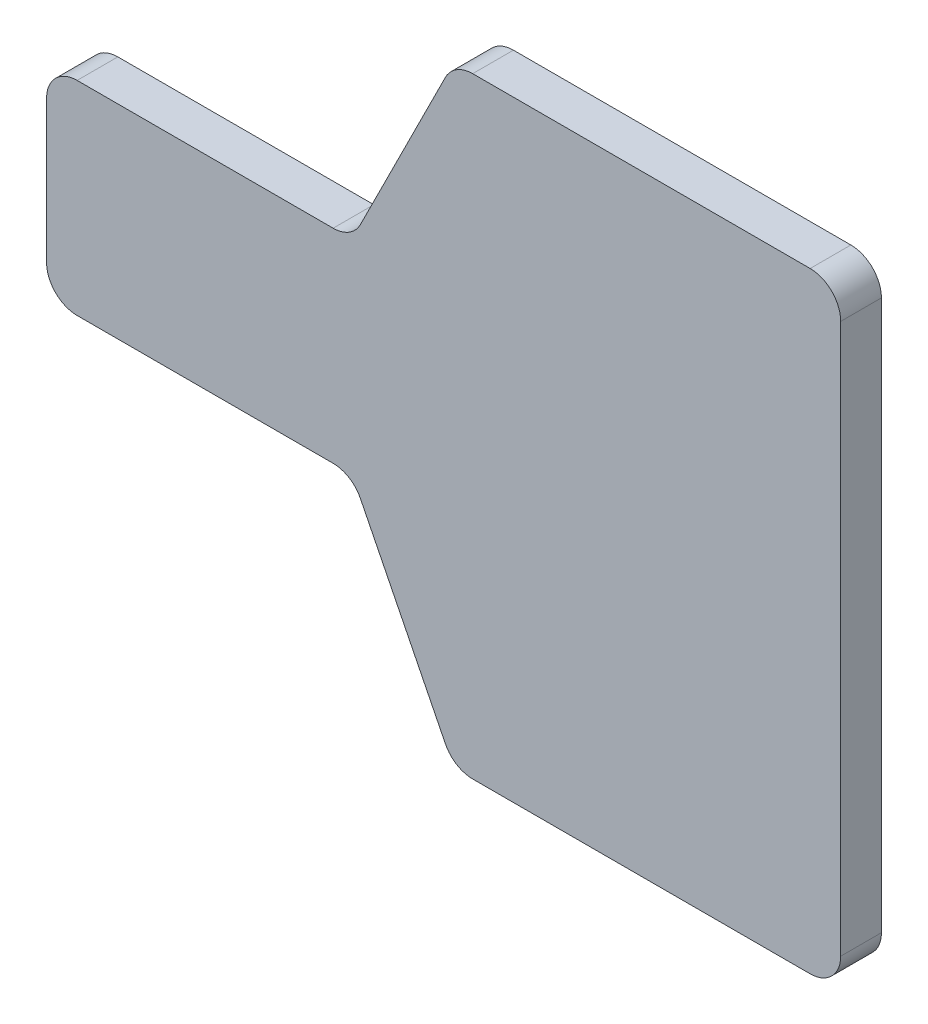
ISO-10303-21;
HEADER;
FILE_DESCRIPTION(('STEP AP214'),'2;1');
FILE_NAME('part.step','',(''),(''),'','','');
FILE_SCHEMA(('AUTOMOTIVE_DESIGN { 1 0 10303 214 1 1 1 1 }'));
ENDSEC;
DATA;
#1=APPLICATION_CONTEXT('core data for automotive mechanical design processes');
#2=APPLICATION_PROTOCOL_DEFINITION('international standard','automotive_design',2000,#1);
#3=PRODUCT_CONTEXT('',#1,'mechanical');
#4=PRODUCT('Part','Part','',(#3));
#5=PRODUCT_RELATED_PRODUCT_CATEGORY('part','',(#4));
#6=PRODUCT_DEFINITION_FORMATION('','',#4);
#7=PRODUCT_DEFINITION_CONTEXT('part definition',#1,'design');
#8=PRODUCT_DEFINITION('design','',#6,#7);
#9=PRODUCT_DEFINITION_SHAPE('','',#8);
#10=(LENGTH_UNIT() NAMED_UNIT(*) SI_UNIT(.MILLI.,.METRE.));
#11=(NAMED_UNIT(*) PLANE_ANGLE_UNIT() SI_UNIT($,.RADIAN.));
#12=(NAMED_UNIT(*) SI_UNIT($,.STERADIAN.) SOLID_ANGLE_UNIT());
#13=UNCERTAINTY_MEASURE_WITH_UNIT(LENGTH_MEASURE(1.E-05),#10,'distance_accuracy_value','');
#14=(GEOMETRIC_REPRESENTATION_CONTEXT(3) GLOBAL_UNCERTAINTY_ASSIGNED_CONTEXT((#13)) GLOBAL_UNIT_ASSIGNED_CONTEXT((#10,
#11,#12)) REPRESENTATION_CONTEXT('',''));
#15=CARTESIAN_POINT('',(0.,0.,0.));
#16=DIRECTION('',(0.,0.,1.));
#17=DIRECTION('',(1.,0.,0.));
#18=AXIS2_PLACEMENT_3D('',#15,#16,#17);
#19=CARTESIAN_POINT('',(0.,-10.,4.));
#20=DIRECTION('',(0.,1.,0.));
#21=DIRECTION('',(0.,0.,1.));
#22=AXIS2_PLACEMENT_3D('',#19,#20,#21);
#23=PLANE('',#22);
#24=DIRECTION('',(1.,0.,0.));
#25=VECTOR('',#24,1.);
#26=CARTESIAN_POINT('',(0.,-10.,0.));
#27=LINE('',#26,#25);
#28=CARTESIAN_POINT('',(-27.,-10.,0.));
#29=VERTEX_POINT('',#28);
#30=CARTESIAN_POINT('',(-1.85410196624969,-10.,0.));
#31=VERTEX_POINT('',#30);
#32=EDGE_CURVE('E246',#29,#31,#27,.T.);
#33=ORIENTED_EDGE('',*,*,#32,.T.);
#34=DIRECTION('',(0.,0.,-1.));
#35=VECTOR('',#34,1.);
#36=CARTESIAN_POINT('',(-1.85410196624969,-10.,4.));
#37=LINE('',#36,#35);
#38=CARTESIAN_POINT('',(-1.85410196624969,-10.,4.));
#39=VERTEX_POINT('',#38);
#40=EDGE_CURVE('E239',#31,#39,#37,.F.);
#41=ORIENTED_EDGE('',*,*,#40,.T.);
#42=DIRECTION('',(1.,0.,0.));
#43=VECTOR('',#42,1.);
#44=CARTESIAN_POINT('',(0.,-10.,4.));
#45=LINE('',#44,#43);
#46=CARTESIAN_POINT('',(-27.,-10.,4.));
#47=VERTEX_POINT('',#46);
#48=EDGE_CURVE('E179',#47,#39,#45,.T.);
#49=ORIENTED_EDGE('',*,*,#48,.F.);
#50=DIRECTION('',(0.,0.,-1.));
#51=VECTOR('',#50,1.);
#52=CARTESIAN_POINT('',(-27.,-10.,4.));
#53=LINE('',#52,#51);
#54=EDGE_CURVE('E236',#47,#29,#53,.T.);
#55=ORIENTED_EDGE('',*,*,#54,.T.);
#56=EDGE_LOOP('',(#33,#41,#49,#55));
#57=FACE_BOUND('',#56,.T.);
#58=ADVANCED_FACE('F39',(#57),#23,.F.);
#59=CARTESIAN_POINT('',(0.,-10.,4.));
#60=DIRECTION('',(0.894427190999916,0.447213595499958,0.));
#61=DIRECTION('',(-0.447213595499958,0.894427190999916,0.));
#62=AXIS2_PLACEMENT_3D('',#59,#60,#61);
#63=PLANE('',#62);
#64=DIRECTION('',(0.447213595499958,-0.894427190999916,0.));
#65=VECTOR('',#64,1.);
#66=CARTESIAN_POINT('',(0.,-10.,0.));
#67=LINE('',#66,#65);
#68=CARTESIAN_POINT('',(0.82917960675006,-11.6583592135001,0.));
#69=VERTEX_POINT('',#68);
#70=CARTESIAN_POINT('',(9.17082039324994,-28.3416407864999,0.));
#71=VERTEX_POINT('',#70);
#72=EDGE_CURVE('E248',#69,#71,#67,.T.);
#73=ORIENTED_EDGE('',*,*,#72,.T.);
#74=DIRECTION('',(0.,0.,-1.));
#75=VECTOR('',#74,1.);
#76=CARTESIAN_POINT('',(9.17082039324994,-28.3416407864999,4.));
#77=LINE('',#76,#75);
#78=CARTESIAN_POINT('',(9.17082039324994,-28.3416407864999,4.));
#79=VERTEX_POINT('',#78);
#80=EDGE_CURVE('E234',#71,#79,#77,.F.);
#81=ORIENTED_EDGE('',*,*,#80,.T.);
#82=DIRECTION('',(0.447213595499958,-0.894427190999916,0.));
#83=VECTOR('',#82,1.);
#84=CARTESIAN_POINT('',(0.,-10.,4.));
#85=LINE('',#84,#83);
#86=CARTESIAN_POINT('',(0.82917960675006,-11.6583592135001,4.));
#87=VERTEX_POINT('',#86);
#88=EDGE_CURVE('E183',#87,#79,#85,.T.);
#89=ORIENTED_EDGE('',*,*,#88,.F.);
#90=DIRECTION('',(0.,0.,-1.));
#91=VECTOR('',#90,1.);
#92=CARTESIAN_POINT('',(0.82917960675006,-11.6583592135001,0.));
#93=LINE('',#92,#91);
#94=EDGE_CURVE('E231',#87,#69,#93,.T.);
#95=ORIENTED_EDGE('',*,*,#94,.T.);
#96=EDGE_LOOP('',(#73,#81,#89,#95));
#97=FACE_BOUND('',#96,.T.);
#98=ADVANCED_FACE('F264',(#97),#63,.F.);
#99=CARTESIAN_POINT('',(48.,-30.,4.));
#100=DIRECTION('',(0.,1.,0.));
#101=DIRECTION('',(-1.,0.,0.));
#102=AXIS2_PLACEMENT_3D('',#99,#100,#101);
#103=PLANE('',#102);
#104=DIRECTION('',(1.,0.,0.));
#105=VECTOR('',#104,1.);
#106=CARTESIAN_POINT('',(48.,-30.,0.));
#107=LINE('',#106,#105);
#108=CARTESIAN_POINT('',(11.8541019662497,-30.,0.));
#109=VERTEX_POINT('',#108);
#110=CARTESIAN_POINT('',(45.,-30.,0.));
#111=VERTEX_POINT('',#110);
#112=EDGE_CURVE('E282',#109,#111,#107,.T.);
#113=ORIENTED_EDGE('',*,*,#112,.T.);
#114=DIRECTION('',(0.,0.,-1.));
#115=VECTOR('',#114,1.);
#116=CARTESIAN_POINT('',(45.,-30.,4.));
#117=LINE('',#116,#115);
#118=CARTESIAN_POINT('',(45.,-30.,4.));
#119=VERTEX_POINT('',#118);
#120=EDGE_CURVE('E229',#111,#119,#117,.F.);
#121=ORIENTED_EDGE('',*,*,#120,.T.);
#122=DIRECTION('',(1.,0.,0.));
#123=VECTOR('',#122,1.);
#124=CARTESIAN_POINT('',(30.,-30.,4.));
#125=LINE('',#124,#123);
#126=CARTESIAN_POINT('',(11.8541019662497,-30.,4.));
#127=VERTEX_POINT('',#126);
#128=EDGE_CURVE('E266',#127,#119,#125,.T.);
#129=ORIENTED_EDGE('',*,*,#128,.F.);
#130=DIRECTION('',(0.,0.,-1.));
#131=VECTOR('',#130,1.);
#132=CARTESIAN_POINT('',(11.8541019662497,-30.,4.));
#133=LINE('',#132,#131);
#134=EDGE_CURVE('E226',#127,#109,#133,.T.);
#135=ORIENTED_EDGE('',*,*,#134,.T.);
#136=EDGE_LOOP('',(#113,#121,#129,#135));
#137=FACE_BOUND('',#136,.T.);
#138=ADVANCED_FACE('F314',(#137),#103,.F.);
#139=CARTESIAN_POINT('',(48.,30.,4.));
#140=DIRECTION('',(-1.,0.,0.));
#141=DIRECTION('',(0.,-1.,0.));
#142=AXIS2_PLACEMENT_3D('',#139,#140,#141);
#143=PLANE('',#142);
#144=DIRECTION('',(0.,1.,0.));
#145=VECTOR('',#144,1.);
#146=CARTESIAN_POINT('',(48.,30.,0.));
#147=LINE('',#146,#145);
#148=CARTESIAN_POINT('',(48.,-27.,0.));
#149=VERTEX_POINT('',#148);
#150=CARTESIAN_POINT('',(48.,27.,0.));
#151=VERTEX_POINT('',#150);
#152=EDGE_CURVE('E285',#149,#151,#147,.T.);
#153=ORIENTED_EDGE('',*,*,#152,.T.);
#154=DIRECTION('',(0.,0.,-1.));
#155=VECTOR('',#154,1.);
#156=CARTESIAN_POINT('',(48.,27.,4.));
#157=LINE('',#156,#155);
#158=CARTESIAN_POINT('',(48.,27.,4.));
#159=VERTEX_POINT('',#158);
#160=EDGE_CURVE('E224',#151,#159,#157,.F.);
#161=ORIENTED_EDGE('',*,*,#160,.T.);
#162=DIRECTION('',(0.,1.,0.));
#163=VECTOR('',#162,1.);
#164=CARTESIAN_POINT('',(48.,30.,4.));
#165=LINE('',#164,#163);
#166=CARTESIAN_POINT('',(48.,-27.,4.));
#167=VERTEX_POINT('',#166);
#168=EDGE_CURVE('E269',#167,#159,#165,.T.);
#169=ORIENTED_EDGE('',*,*,#168,.F.);
#170=DIRECTION('',(0.,0.,-1.));
#171=VECTOR('',#170,1.);
#172=CARTESIAN_POINT('',(48.,-27.,4.));
#173=LINE('',#172,#171);
#174=EDGE_CURVE('E221',#167,#149,#173,.T.);
#175=ORIENTED_EDGE('',*,*,#174,.T.);
#176=EDGE_LOOP('',(#153,#161,#169,#175));
#177=FACE_BOUND('',#176,.T.);
#178=ADVANCED_FACE('F439',(#177),#143,.F.);
#179=CARTESIAN_POINT('',(30.,30.,4.));
#180=DIRECTION('',(0.,-1.,0.));
#181=DIRECTION('',(0.,0.,-1.));
#182=AXIS2_PLACEMENT_3D('',#179,#180,#181);
#183=PLANE('',#182);
#184=DIRECTION('',(-1.,0.,0.));
#185=VECTOR('',#184,1.);
#186=CARTESIAN_POINT('',(30.,30.,0.));
#187=LINE('',#186,#185);
#188=CARTESIAN_POINT('',(45.,30.,0.));
#189=VERTEX_POINT('',#188);
#190=CARTESIAN_POINT('',(11.8541019662497,30.,0.));
#191=VERTEX_POINT('',#190);
#192=EDGE_CURVE('E288',#189,#191,#187,.T.);
#193=ORIENTED_EDGE('',*,*,#192,.T.);
#194=DIRECTION('',(0.,0.,-1.));
#195=VECTOR('',#194,1.);
#196=CARTESIAN_POINT('',(11.8541019662497,30.,4.));
#197=LINE('',#196,#195);
#198=CARTESIAN_POINT('',(11.8541019662497,30.,4.));
#199=VERTEX_POINT('',#198);
#200=EDGE_CURVE('E219',#191,#199,#197,.F.);
#201=ORIENTED_EDGE('',*,*,#200,.T.);
#202=DIRECTION('',(-1.,0.,0.));
#203=VECTOR('',#202,1.);
#204=CARTESIAN_POINT('',(30.,30.,4.));
#205=LINE('',#204,#203);
#206=CARTESIAN_POINT('',(45.,30.,4.));
#207=VERTEX_POINT('',#206);
#208=EDGE_CURVE('E274',#207,#199,#205,.T.);
#209=ORIENTED_EDGE('',*,*,#208,.F.);
#210=DIRECTION('',(0.,0.,-1.));
#211=VECTOR('',#210,1.);
#212=CARTESIAN_POINT('',(45.,30.,4.));
#213=LINE('',#212,#211);
#214=EDGE_CURVE('E216',#207,#189,#213,.T.);
#215=ORIENTED_EDGE('',*,*,#214,.T.);
#216=EDGE_LOOP('',(#193,#201,#209,#215));
#217=FACE_BOUND('',#216,.T.);
#218=ADVANCED_FACE('F307',(#217),#183,.F.);
#219=CARTESIAN_POINT('',(10.,30.,4.));
#220=DIRECTION('',(0.894427190999916,-0.447213595499958,0.));
#221=DIRECTION('',(0.447213595499958,0.894427190999916,0.));
#222=AXIS2_PLACEMENT_3D('',#219,#220,#221);
#223=PLANE('',#222);
#224=DIRECTION('',(-0.447213595499958,-0.894427190999916,0.));
#225=VECTOR('',#224,1.);
#226=CARTESIAN_POINT('',(10.,30.,0.));
#227=LINE('',#226,#225);
#228=CARTESIAN_POINT('',(9.17082039324994,28.3416407864999,0.));
#229=VERTEX_POINT('',#228);
#230=CARTESIAN_POINT('',(0.829179606750063,11.6583592135001,0.));
#231=VERTEX_POINT('',#230);
#232=EDGE_CURVE('E185',#229,#231,#227,.T.);
#233=ORIENTED_EDGE('',*,*,#232,.T.);
#234=DIRECTION('',(0.,0.,-1.));
#235=VECTOR('',#234,1.);
#236=CARTESIAN_POINT('',(0.829179606750064,11.6583592135001,4.));
#237=LINE('',#236,#235);
#238=CARTESIAN_POINT('',(0.829179606750063,11.6583592135001,4.));
#239=VERTEX_POINT('',#238);
#240=EDGE_CURVE('E54',#231,#239,#237,.F.);
#241=ORIENTED_EDGE('',*,*,#240,.T.);
#242=DIRECTION('',(-0.447213595499958,-0.894427190999916,0.));
#243=VECTOR('',#242,1.);
#244=CARTESIAN_POINT('',(10.,30.,4.));
#245=LINE('',#244,#243);
#246=CARTESIAN_POINT('',(9.17082039324994,28.3416407864999,4.));
#247=VERTEX_POINT('',#246);
#248=EDGE_CURVE('E276',#247,#239,#245,.T.);
#249=ORIENTED_EDGE('',*,*,#248,.F.);
#250=DIRECTION('',(0.,0.,-1.));
#251=VECTOR('',#250,1.);
#252=CARTESIAN_POINT('',(9.17082039324994,28.3416407864999,4.));
#253=LINE('',#252,#251);
#254=EDGE_CURVE('E212',#247,#229,#253,.T.);
#255=ORIENTED_EDGE('',*,*,#254,.T.);
#256=EDGE_LOOP('',(#233,#241,#249,#255));
#257=FACE_BOUND('',#256,.T.);
#258=ADVANCED_FACE('F291',(#257),#223,.F.);
#259=CARTESIAN_POINT('',(0.,10.,4.));
#260=DIRECTION('',(0.,-1.,0.));
#261=DIRECTION('',(0.,0.,-1.));
#262=AXIS2_PLACEMENT_3D('',#259,#260,#261);
#263=PLANE('',#262);
#264=DIRECTION('',(-1.,0.,0.));
#265=VECTOR('',#264,1.);
#266=CARTESIAN_POINT('',(0.,10.,0.));
#267=LINE('',#266,#265);
#268=CARTESIAN_POINT('',(-1.85410196624969,10.,0.));
#269=VERTEX_POINT('',#268);
#270=CARTESIAN_POINT('',(-27.,10.,0.));
#271=VERTEX_POINT('',#270);
#272=EDGE_CURVE('E180',#269,#271,#267,.T.);
#273=ORIENTED_EDGE('',*,*,#272,.T.);
#274=DIRECTION('',(0.,0.,-1.));
#275=VECTOR('',#274,1.);
#276=CARTESIAN_POINT('',(-27.,10.,4.));
#277=LINE('',#276,#275);
#278=CARTESIAN_POINT('',(-27.,10.,4.));
#279=VERTEX_POINT('',#278);
#280=EDGE_CURVE('E158',#271,#279,#277,.F.);
#281=ORIENTED_EDGE('',*,*,#280,.T.);
#282=DIRECTION('',(-1.,0.,0.));
#283=VECTOR('',#282,1.);
#284=CARTESIAN_POINT('',(0.,10.,4.));
#285=LINE('',#284,#283);
#286=CARTESIAN_POINT('',(-1.85410196624969,10.,4.));
#287=VERTEX_POINT('',#286);
#288=EDGE_CURVE('E278',#287,#279,#285,.T.);
#289=ORIENTED_EDGE('',*,*,#288,.F.);
#290=DIRECTION('',(0.,0.,-1.));
#291=VECTOR('',#290,1.);
#292=CARTESIAN_POINT('',(-1.85410196624969,10.,0.));
#293=LINE('',#292,#291);
#294=EDGE_CURVE('E163',#287,#269,#293,.T.);
#295=ORIENTED_EDGE('',*,*,#294,.T.);
#296=EDGE_LOOP('',(#273,#281,#289,#295));
#297=FACE_BOUND('',#296,.T.);
#298=ADVANCED_FACE('F299',(#297),#263,.F.);
#299=CARTESIAN_POINT('',(-30.,-10.,4.));
#300=DIRECTION('',(1.,0.,0.));
#301=DIRECTION('',(0.,0.,-1.));
#302=AXIS2_PLACEMENT_3D('',#299,#300,#301);
#303=PLANE('',#302);
#304=DIRECTION('',(0.,-1.,0.));
#305=VECTOR('',#304,1.);
#306=CARTESIAN_POINT('',(-30.,-10.,4.));
#307=LINE('',#306,#305);
#308=CARTESIAN_POINT('',(-30.,7.,4.));
#309=VERTEX_POINT('',#308);
#310=CARTESIAN_POINT('',(-30.,-7.,4.));
#311=VERTEX_POINT('',#310);
#312=EDGE_CURVE('E173',#309,#311,#307,.T.);
#313=ORIENTED_EDGE('',*,*,#312,.F.);
#314=DIRECTION('',(0.,0.,-1.));
#315=VECTOR('',#314,1.);
#316=CARTESIAN_POINT('',(-30.,7.,4.));
#317=LINE('',#316,#315);
#318=CARTESIAN_POINT('',(-30.,7.,0.));
#319=VERTEX_POINT('',#318);
#320=EDGE_CURVE('E157',#309,#319,#317,.T.);
#321=ORIENTED_EDGE('',*,*,#320,.T.);
#322=DIRECTION('',(0.,-1.,0.));
#323=VECTOR('',#322,1.);
#324=CARTESIAN_POINT('',(-30.,-10.,0.));
#325=LINE('',#324,#323);
#326=CARTESIAN_POINT('',(-30.,-7.,0.));
#327=VERTEX_POINT('',#326);
#328=EDGE_CURVE('E170',#319,#327,#325,.T.);
#329=ORIENTED_EDGE('',*,*,#328,.T.);
#330=DIRECTION('',(0.,0.,-1.));
#331=VECTOR('',#330,1.);
#332=CARTESIAN_POINT('',(-30.,-7.,4.));
#333=LINE('',#332,#331);
#334=EDGE_CURVE('E175',#327,#311,#333,.F.);
#335=ORIENTED_EDGE('',*,*,#334,.T.);
#336=EDGE_LOOP('',(#313,#321,#329,#335));
#337=FACE_BOUND('',#336,.T.);
#338=ADVANCED_FACE('F169',(#337),#303,.F.);
#339=CARTESIAN_POINT('',(0.,0.,4.));
#340=DIRECTION('',(0.,0.,-1.));
#341=DIRECTION('',(-1.,0.,0.));
#342=AXIS2_PLACEMENT_3D('',#339,#340,#341);
#343=PLANE('',#342);
#344=ORIENTED_EDGE('',*,*,#288,.T.);
#345=CARTESIAN_POINT('',(-27.,7.,4.));
#346=DIRECTION('',(0.,0.,-1.));
#347=DIRECTION('',(-1.,0.,0.));
#348=AXIS2_PLACEMENT_3D('',#345,#346,#347);
#349=CIRCLE('',#348,3.);
#350=EDGE_CURVE('E210',#279,#309,#349,.F.);
#351=ORIENTED_EDGE('',*,*,#350,.T.);
#352=ORIENTED_EDGE('',*,*,#312,.T.);
#353=CARTESIAN_POINT('',(-27.,-7.,4.));
#354=DIRECTION('',(0.,0.,-1.));
#355=DIRECTION('',(-1.,0.,0.));
#356=AXIS2_PLACEMENT_3D('',#353,#354,#355);
#357=CIRCLE('',#356,3.);
#358=EDGE_CURVE('E201',#311,#47,#357,.F.);
#359=ORIENTED_EDGE('',*,*,#358,.T.);
#360=ORIENTED_EDGE('',*,*,#48,.T.);
#361=CARTESIAN_POINT('',(-1.85410196624969,-13.,4.));
#362=DIRECTION('',(0.,0.,-1.));
#363=DIRECTION('',(-1.,0.,0.));
#364=AXIS2_PLACEMENT_3D('',#361,#362,#363);
#365=CIRCLE('',#364,3.);
#366=EDGE_CURVE('E11',#39,#87,#365,.T.);
#367=ORIENTED_EDGE('',*,*,#366,.T.);
#368=ORIENTED_EDGE('',*,*,#88,.T.);
#369=CARTESIAN_POINT('',(11.8541019662497,-27.,4.));
#370=DIRECTION('',(0.,0.,-1.));
#371=DIRECTION('',(-1.,0.,0.));
#372=AXIS2_PLACEMENT_3D('',#369,#370,#371);
#373=CIRCLE('',#372,3.);
#374=EDGE_CURVE('E203',#79,#127,#373,.F.);
#375=ORIENTED_EDGE('',*,*,#374,.T.);
#376=ORIENTED_EDGE('',*,*,#128,.T.);
#377=CARTESIAN_POINT('',(45.,-27.,4.));
#378=DIRECTION('',(0.,0.,-1.));
#379=DIRECTION('',(-1.,0.,0.));
#380=AXIS2_PLACEMENT_3D('',#377,#378,#379);
#381=CIRCLE('',#380,3.);
#382=EDGE_CURVE('E205',#119,#167,#381,.F.);
#383=ORIENTED_EDGE('',*,*,#382,.T.);
#384=ORIENTED_EDGE('',*,*,#168,.T.);
#385=CARTESIAN_POINT('',(45.,27.,4.));
#386=DIRECTION('',(0.,0.,-1.));
#387=DIRECTION('',(-1.,0.,0.));
#388=AXIS2_PLACEMENT_3D('',#385,#386,#387);
#389=CIRCLE('',#388,3.);
#390=EDGE_CURVE('E207',#159,#207,#389,.F.);
#391=ORIENTED_EDGE('',*,*,#390,.T.);
#392=ORIENTED_EDGE('',*,*,#208,.T.);
#393=CARTESIAN_POINT('',(11.8541019662497,27.,4.));
#394=DIRECTION('',(0.,0.,-1.));
#395=DIRECTION('',(-1.,0.,0.));
#396=AXIS2_PLACEMENT_3D('',#393,#394,#395);
#397=CIRCLE('',#396,3.);
#398=EDGE_CURVE('E61',#199,#247,#397,.F.);
#399=ORIENTED_EDGE('',*,*,#398,.T.);
#400=ORIENTED_EDGE('',*,*,#248,.T.);
#401=CARTESIAN_POINT('',(-1.85410196624969,13.,4.));
#402=DIRECTION('',(0.,0.,-1.));
#403=DIRECTION('',(-1.,0.,0.));
#404=AXIS2_PLACEMENT_3D('',#401,#402,#403);
#405=CIRCLE('',#404,3.);
#406=EDGE_CURVE('E243',#239,#287,#405,.T.);
#407=ORIENTED_EDGE('',*,*,#406,.T.);
#408=EDGE_LOOP('',(#344,#351,#352,#359,#360,#367,#368,#375,#376,#383,#384,#391,#392,#399,#400,#407));
#409=FACE_BOUND('',#408,.T.);
#410=ADVANCED_FACE('F261',(#409),#343,.F.);
#411=CARTESIAN_POINT('',(0.,0.,0.));
#412=DIRECTION('',(0.,0.,-1.));
#413=DIRECTION('',(-1.,0.,0.));
#414=AXIS2_PLACEMENT_3D('',#411,#412,#413);
#415=PLANE('',#414);
#416=ORIENTED_EDGE('',*,*,#328,.F.);
#417=CARTESIAN_POINT('',(-27.,7.,0.));
#418=DIRECTION('',(0.,0.,-1.));
#419=DIRECTION('',(-1.,0.,0.));
#420=AXIS2_PLACEMENT_3D('',#417,#418,#419);
#421=CIRCLE('',#420,3.);
#422=EDGE_CURVE('E153',#319,#271,#421,.T.);
#423=ORIENTED_EDGE('',*,*,#422,.T.);
#424=ORIENTED_EDGE('',*,*,#272,.F.);
#425=CARTESIAN_POINT('',(-1.85410196624969,13.,0.));
#426=DIRECTION('',(0.,0.,-1.));
#427=DIRECTION('',(-1.,0.,0.));
#428=AXIS2_PLACEMENT_3D('',#425,#426,#427);
#429=CIRCLE('',#428,3.);
#430=EDGE_CURVE('E241',#269,#231,#429,.F.);
#431=ORIENTED_EDGE('',*,*,#430,.T.);
#432=ORIENTED_EDGE('',*,*,#232,.F.);
#433=CARTESIAN_POINT('',(11.8541019662497,27.,0.));
#434=DIRECTION('',(0.,0.,-1.));
#435=DIRECTION('',(-1.,0.,0.));
#436=AXIS2_PLACEMENT_3D('',#433,#434,#435);
#437=CIRCLE('',#436,3.);
#438=EDGE_CURVE('E164',#229,#191,#437,.T.);
#439=ORIENTED_EDGE('',*,*,#438,.T.);
#440=ORIENTED_EDGE('',*,*,#192,.F.);
#441=CARTESIAN_POINT('',(45.,27.,0.));
#442=DIRECTION('',(0.,0.,-1.));
#443=DIRECTION('',(-1.,0.,0.));
#444=AXIS2_PLACEMENT_3D('',#441,#442,#443);
#445=CIRCLE('',#444,3.);
#446=EDGE_CURVE('E195',#189,#151,#445,.T.);
#447=ORIENTED_EDGE('',*,*,#446,.T.);
#448=ORIENTED_EDGE('',*,*,#152,.F.);
#449=CARTESIAN_POINT('',(45.,-27.,0.));
#450=DIRECTION('',(0.,0.,-1.));
#451=DIRECTION('',(-1.,0.,0.));
#452=AXIS2_PLACEMENT_3D('',#449,#450,#451);
#453=CIRCLE('',#452,3.);
#454=EDGE_CURVE('E193',#149,#111,#453,.T.);
#455=ORIENTED_EDGE('',*,*,#454,.T.);
#456=ORIENTED_EDGE('',*,*,#112,.F.);
#457=CARTESIAN_POINT('',(11.8541019662497,-27.,0.));
#458=DIRECTION('',(0.,0.,-1.));
#459=DIRECTION('',(-1.,0.,0.));
#460=AXIS2_PLACEMENT_3D('',#457,#458,#459);
#461=CIRCLE('',#460,3.);
#462=EDGE_CURVE('E191',#109,#71,#461,.T.);
#463=ORIENTED_EDGE('',*,*,#462,.T.);
#464=ORIENTED_EDGE('',*,*,#72,.F.);
#465=CARTESIAN_POINT('',(-1.85410196624969,-13.,0.));
#466=DIRECTION('',(0.,0.,-1.));
#467=DIRECTION('',(-1.,0.,0.));
#468=AXIS2_PLACEMENT_3D('',#465,#466,#467);
#469=CIRCLE('',#468,3.);
#470=EDGE_CURVE('E47',#69,#31,#469,.F.);
#471=ORIENTED_EDGE('',*,*,#470,.T.);
#472=ORIENTED_EDGE('',*,*,#32,.F.);
#473=CARTESIAN_POINT('',(-27.,-7.,0.));
#474=DIRECTION('',(0.,0.,-1.));
#475=DIRECTION('',(-1.,0.,0.));
#476=AXIS2_PLACEMENT_3D('',#473,#474,#475);
#477=CIRCLE('',#476,3.);
#478=EDGE_CURVE('E174',#29,#327,#477,.T.);
#479=ORIENTED_EDGE('',*,*,#478,.T.);
#480=EDGE_LOOP('',(#416,#423,#424,#431,#432,#439,#440,#447,#448,#455,#456,#463,#464,#471,#472,#479));
#481=FACE_BOUND('',#480,.T.);
#482=ADVANCED_FACE('F177',(#481),#415,.T.);
#483=CARTESIAN_POINT('',(-27.,7.,4.));
#484=DIRECTION('',(0.,0.,-1.));
#485=DIRECTION('',(-1.,0.,0.));
#486=AXIS2_PLACEMENT_3D('',#483,#484,#485);
#487=CYLINDRICAL_SURFACE('',#486,3.);
#488=ORIENTED_EDGE('',*,*,#350,.F.);
#489=ORIENTED_EDGE('',*,*,#280,.F.);
#490=ORIENTED_EDGE('',*,*,#422,.F.);
#491=ORIENTED_EDGE('',*,*,#320,.F.);
#492=EDGE_LOOP('',(#488,#489,#490,#491));
#493=FACE_BOUND('',#492,.T.);
#494=ADVANCED_FACE('F156',(#493),#487,.T.);
#495=CARTESIAN_POINT('',(-1.85410196624969,13.,4.));
#496=DIRECTION('',(0.,0.,1.));
#497=DIRECTION('',(1.,0.,0.));
#498=AXIS2_PLACEMENT_3D('',#495,#496,#497);
#499=CYLINDRICAL_SURFACE('',#498,3.);
#500=ORIENTED_EDGE('',*,*,#406,.F.);
#501=ORIENTED_EDGE('',*,*,#240,.F.);
#502=ORIENTED_EDGE('',*,*,#430,.F.);
#503=ORIENTED_EDGE('',*,*,#294,.F.);
#504=EDGE_LOOP('',(#500,#501,#502,#503));
#505=FACE_BOUND('',#504,.T.);
#506=ADVANCED_FACE('F295',(#505),#499,.F.);
#507=CARTESIAN_POINT('',(11.8541019662497,27.,4.));
#508=DIRECTION('',(0.,0.,-1.));
#509=DIRECTION('',(-1.,0.,0.));
#510=AXIS2_PLACEMENT_3D('',#507,#508,#509);
#511=CYLINDRICAL_SURFACE('',#510,3.);
#512=ORIENTED_EDGE('',*,*,#398,.F.);
#513=ORIENTED_EDGE('',*,*,#200,.F.);
#514=ORIENTED_EDGE('',*,*,#438,.F.);
#515=ORIENTED_EDGE('',*,*,#254,.F.);
#516=EDGE_LOOP('',(#512,#513,#514,#515));
#517=FACE_BOUND('',#516,.T.);
#518=ADVANCED_FACE('F322',(#517),#511,.T.);
#519=CARTESIAN_POINT('',(45.,27.,4.));
#520=DIRECTION('',(0.,0.,-1.));
#521=DIRECTION('',(-1.,0.,0.));
#522=AXIS2_PLACEMENT_3D('',#519,#520,#521);
#523=CYLINDRICAL_SURFACE('',#522,3.);
#524=ORIENTED_EDGE('',*,*,#390,.F.);
#525=ORIENTED_EDGE('',*,*,#160,.F.);
#526=ORIENTED_EDGE('',*,*,#446,.F.);
#527=ORIENTED_EDGE('',*,*,#214,.F.);
#528=EDGE_LOOP('',(#524,#525,#526,#527));
#529=FACE_BOUND('',#528,.T.);
#530=ADVANCED_FACE('F325',(#529),#523,.T.);
#531=CARTESIAN_POINT('',(45.,-27.,4.));
#532=DIRECTION('',(0.,0.,-1.));
#533=DIRECTION('',(-1.,0.,0.));
#534=AXIS2_PLACEMENT_3D('',#531,#532,#533);
#535=CYLINDRICAL_SURFACE('',#534,3.);
#536=ORIENTED_EDGE('',*,*,#382,.F.);
#537=ORIENTED_EDGE('',*,*,#120,.F.);
#538=ORIENTED_EDGE('',*,*,#454,.F.);
#539=ORIENTED_EDGE('',*,*,#174,.F.);
#540=EDGE_LOOP('',(#536,#537,#538,#539));
#541=FACE_BOUND('',#540,.T.);
#542=ADVANCED_FACE('F329',(#541),#535,.T.);
#543=CARTESIAN_POINT('',(11.8541019662497,-27.,4.));
#544=DIRECTION('',(0.,0.,-1.));
#545=DIRECTION('',(-1.,0.,0.));
#546=AXIS2_PLACEMENT_3D('',#543,#544,#545);
#547=CYLINDRICAL_SURFACE('',#546,3.);
#548=ORIENTED_EDGE('',*,*,#374,.F.);
#549=ORIENTED_EDGE('',*,*,#80,.F.);
#550=ORIENTED_EDGE('',*,*,#462,.F.);
#551=ORIENTED_EDGE('',*,*,#134,.F.);
#552=EDGE_LOOP('',(#548,#549,#550,#551));
#553=FACE_BOUND('',#552,.T.);
#554=ADVANCED_FACE('F333',(#553),#547,.T.);
#555=CARTESIAN_POINT('',(-1.85410196624969,-13.,4.));
#556=DIRECTION('',(0.,0.,1.));
#557=DIRECTION('',(1.,0.,0.));
#558=AXIS2_PLACEMENT_3D('',#555,#556,#557);
#559=CYLINDRICAL_SURFACE('',#558,3.);
#560=ORIENTED_EDGE('',*,*,#366,.F.);
#561=ORIENTED_EDGE('',*,*,#40,.F.);
#562=ORIENTED_EDGE('',*,*,#470,.F.);
#563=ORIENTED_EDGE('',*,*,#94,.F.);
#564=EDGE_LOOP('',(#560,#561,#562,#563));
#565=FACE_BOUND('',#564,.T.);
#566=ADVANCED_FACE('F257',(#565),#559,.F.);
#567=CARTESIAN_POINT('',(-27.,-7.,4.));
#568=DIRECTION('',(0.,0.,-1.));
#569=DIRECTION('',(-1.,0.,0.));
#570=AXIS2_PLACEMENT_3D('',#567,#568,#569);
#571=CYLINDRICAL_SURFACE('',#570,3.);
#572=ORIENTED_EDGE('',*,*,#358,.F.);
#573=ORIENTED_EDGE('',*,*,#334,.F.);
#574=ORIENTED_EDGE('',*,*,#478,.F.);
#575=ORIENTED_EDGE('',*,*,#54,.F.);
#576=EDGE_LOOP('',(#572,#573,#574,#575));
#577=FACE_BOUND('',#576,.T.);
#578=ADVANCED_FACE('F41',(#577),#571,.T.);
#579=CLOSED_SHELL('',(#58,#98,#138,#178,#218,#258,#298,#338,#410,#482,#494,#506,#518,#530,#542,
#554,#566,#578));
#580=MANIFOLD_SOLID_BREP('B2',#579);
#581=ADVANCED_BREP_SHAPE_REPRESENTATION('',(#18,#580),#14);
#582=SHAPE_DEFINITION_REPRESENTATION(#9,#581);
ENDSEC;
END-ISO-10303-21;
